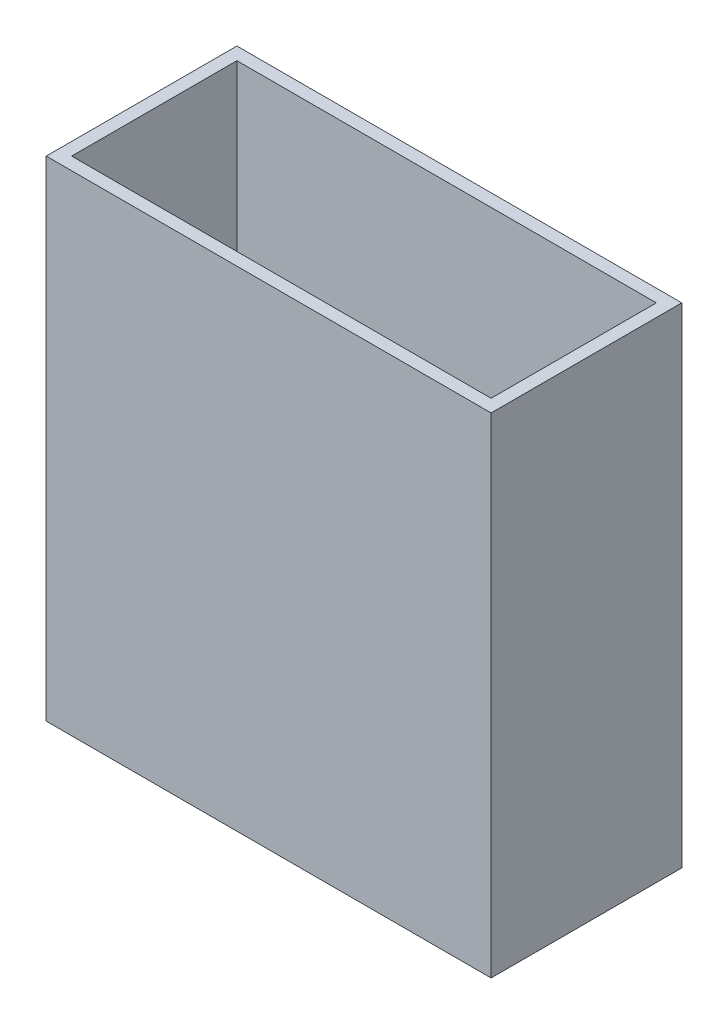
ISO-10303-21;
HEADER;
FILE_DESCRIPTION(('STEP AP214'),'2;1');
FILE_NAME('part.step','',(''),(''),'','','');
FILE_SCHEMA(('AUTOMOTIVE_DESIGN { 1 0 10303 214 1 1 1 1 }'));
ENDSEC;
DATA;
#1=APPLICATION_CONTEXT('core data for automotive mechanical design processes');
#2=APPLICATION_PROTOCOL_DEFINITION('international standard','automotive_design',2000,#1);
#3=PRODUCT_CONTEXT('',#1,'mechanical');
#4=PRODUCT('Part','Part','',(#3));
#5=PRODUCT_RELATED_PRODUCT_CATEGORY('part','',(#4));
#6=PRODUCT_DEFINITION_FORMATION('','',#4);
#7=PRODUCT_DEFINITION_CONTEXT('part definition',#1,'design');
#8=PRODUCT_DEFINITION('design','',#6,#7);
#9=PRODUCT_DEFINITION_SHAPE('','',#8);
#10=(LENGTH_UNIT() NAMED_UNIT(*) SI_UNIT(.MILLI.,.METRE.));
#11=(NAMED_UNIT(*) PLANE_ANGLE_UNIT() SI_UNIT($,.RADIAN.));
#12=(NAMED_UNIT(*) SI_UNIT($,.STERADIAN.) SOLID_ANGLE_UNIT());
#13=UNCERTAINTY_MEASURE_WITH_UNIT(LENGTH_MEASURE(1.E-05),#10,'distance_accuracy_value','');
#14=(GEOMETRIC_REPRESENTATION_CONTEXT(3) GLOBAL_UNCERTAINTY_ASSIGNED_CONTEXT((#13)) GLOBAL_UNIT_ASSIGNED_CONTEXT((#10,
#11,#12)) REPRESENTATION_CONTEXT('',''));
#15=CARTESIAN_POINT('',(0.,0.,0.));
#16=DIRECTION('',(0.,0.,1.));
#17=DIRECTION('',(1.,0.,0.));
#18=AXIS2_PLACEMENT_3D('',#15,#16,#17);
#19=CARTESIAN_POINT('',(4.,150.,4.));
#20=DIRECTION('',(1.,0.,0.));
#21=DIRECTION('',(0.,0.,-1.));
#22=AXIS2_PLACEMENT_3D('',#19,#20,#21);
#23=PLANE('',#22);
#24=DIRECTION('',(0.,-1.,0.));
#25=VECTOR('',#24,1.);
#26=CARTESIAN_POINT('',(4.,9.05,19.));
#27=LINE('',#26,#25);
#28=CARTESIAN_POINT('',(4.,9.05,19.));
#29=VERTEX_POINT('',#28);
#30=CARTESIAN_POINT('',(4.,4.95,19.));
#31=VERTEX_POINT('',#30);
#32=EDGE_CURVE('E187',#29,#31,#27,.T.);
#33=ORIENTED_EDGE('',*,*,#32,.T.);
#34=DIRECTION('',(0.,0.,1.));
#35=VECTOR('',#34,1.);
#36=CARTESIAN_POINT('',(4.,4.95,19.));
#37=LINE('',#36,#35);
#38=CARTESIAN_POINT('',(4.,4.95000000000001,21.5));
#39=VERTEX_POINT('',#38);
#40=EDGE_CURVE('E199',#31,#39,#37,.T.);
#41=ORIENTED_EDGE('',*,*,#40,.T.);
#42=DIRECTION('',(0.,1.,0.));
#43=VECTOR('',#42,1.);
#44=CARTESIAN_POINT('',(4.,9.05,21.5));
#45=LINE('',#44,#43);
#46=CARTESIAN_POINT('',(4.,9.05,21.5));
#47=VERTEX_POINT('',#46);
#48=EDGE_CURVE('E55',#39,#47,#45,.T.);
#49=ORIENTED_EDGE('',*,*,#48,.T.);
#50=DIRECTION('',(0.,0.,-1.));
#51=VECTOR('',#50,1.);
#52=CARTESIAN_POINT('',(4.,9.05,19.));
#53=LINE('',#52,#51);
#54=EDGE_CURVE('E196',#47,#29,#53,.T.);
#55=ORIENTED_EDGE('',*,*,#54,.T.);
#56=EDGE_LOOP('',(#33,#41,#49,#55));
#57=FACE_BOUND('',#56,.T.);
#58=DIRECTION('',(0.,0.,-1.));
#59=VECTOR('',#58,1.);
#60=CARTESIAN_POINT('',(4.,9.04999999999999,41.));
#61=LINE('',#60,#59);
#62=CARTESIAN_POINT('',(4.,9.04999999999999,41.));
#63=VERTEX_POINT('',#62);
#64=CARTESIAN_POINT('',(4.,9.04999999999999,38.5));
#65=VERTEX_POINT('',#64);
#66=EDGE_CURVE('E236',#63,#65,#61,.T.);
#67=ORIENTED_EDGE('',*,*,#66,.T.);
#68=DIRECTION('',(0.,-1.,0.));
#69=VECTOR('',#68,1.);
#70=CARTESIAN_POINT('',(4.,9.04999999999999,38.5));
#71=LINE('',#70,#69);
#72=CARTESIAN_POINT('',(4.,4.95000000000001,38.5));
#73=VERTEX_POINT('',#72);
#74=EDGE_CURVE('E240',#65,#73,#71,.T.);
#75=ORIENTED_EDGE('',*,*,#74,.T.);
#76=DIRECTION('',(0.,0.,1.));
#77=VECTOR('',#76,1.);
#78=CARTESIAN_POINT('',(4.,4.95,41.));
#79=LINE('',#78,#77);
#80=CARTESIAN_POINT('',(4.,4.95,41.));
#81=VERTEX_POINT('',#80);
#82=EDGE_CURVE('E63',#73,#81,#79,.T.);
#83=ORIENTED_EDGE('',*,*,#82,.T.);
#84=DIRECTION('',(0.,1.,0.));
#85=VECTOR('',#84,1.);
#86=CARTESIAN_POINT('',(4.,9.04999999999999,41.));
#87=LINE('',#86,#85);
#88=EDGE_CURVE('E247',#81,#63,#87,.T.);
#89=ORIENTED_EDGE('',*,*,#88,.T.);
#90=EDGE_LOOP('',(#67,#75,#83,#89));
#91=FACE_BOUND('',#90,.T.);
#92=DIRECTION('',(0.,1.,0.));
#93=VECTOR('',#92,1.);
#94=CARTESIAN_POINT('',(4.,0.,33.));
#95=LINE('',#94,#93);
#96=CARTESIAN_POINT('',(4.,0.171428571428573,33.));
#97=VERTEX_POINT('',#96);
#98=CARTESIAN_POINT('',(4.,2.,33.));
#99=VERTEX_POINT('',#98);
#100=EDGE_CURVE('E311',#97,#99,#95,.T.);
#101=ORIENTED_EDGE('',*,*,#100,.T.);
#102=CARTESIAN_POINT('',(4.,2.,30.));
#103=DIRECTION('',(-1.,0.,0.));
#104=DIRECTION('',(0.,0.,-1.));
#105=AXIS2_PLACEMENT_3D('',#102,#103,#104);
#106=ELLIPSE('',#105,3.,2.5);
#107=CARTESIAN_POINT('',(4.,2.,27.));
#108=VERTEX_POINT('',#107);
#109=EDGE_CURVE('E302',#99,#108,#106,.T.);
#110=ORIENTED_EDGE('',*,*,#109,.T.);
#111=DIRECTION('',(0.,-1.,0.));
#112=VECTOR('',#111,1.);
#113=CARTESIAN_POINT('',(4.,0.,27.));
#114=LINE('',#113,#112);
#115=CARTESIAN_POINT('',(4.,0.171428571428572,27.));
#116=VERTEX_POINT('',#115);
#117=EDGE_CURVE('E296',#108,#116,#114,.T.);
#118=ORIENTED_EDGE('',*,*,#117,.T.);
#119=DIRECTION('',(0.,0.,-1.));
#120=VECTOR('',#119,1.);
#121=CARTESIAN_POINT('',(4.,0.171428571428572,4.));
#122=LINE('',#121,#120);
#123=CARTESIAN_POINT('',(4.,0.171428571428557,4.));
#124=VERTEX_POINT('',#123);
#125=EDGE_CURVE('E416',#116,#124,#122,.T.);
#126=ORIENTED_EDGE('',*,*,#125,.T.);
#127=DIRECTION('',(0.,-1.,0.));
#128=VECTOR('',#127,1.);
#129=CARTESIAN_POINT('',(4.,150.,4.));
#130=LINE('',#129,#128);
#131=CARTESIAN_POINT('',(4.,150.,4.));
#132=VERTEX_POINT('',#131);
#133=EDGE_CURVE('E435',#132,#124,#130,.T.);
#134=ORIENTED_EDGE('',*,*,#133,.F.);
#135=DIRECTION('',(0.,0.,1.));
#136=VECTOR('',#135,1.);
#137=CARTESIAN_POINT('',(4.,150.,4.));
#138=LINE('',#137,#136);
#139=CARTESIAN_POINT('',(4.00000000000001,150.,56.));
#140=VERTEX_POINT('',#139);
#141=EDGE_CURVE('E421',#132,#140,#138,.T.);
#142=ORIENTED_EDGE('',*,*,#141,.T.);
#143=DIRECTION('',(0.,-1.,0.));
#144=VECTOR('',#143,1.);
#145=CARTESIAN_POINT('',(4.00000000000001,150.,56.));
#146=LINE('',#145,#144);
#147=CARTESIAN_POINT('',(4.00000000000001,0.171428571428557,56.));
#148=VERTEX_POINT('',#147);
#149=EDGE_CURVE('E447',#140,#148,#146,.T.);
#150=ORIENTED_EDGE('',*,*,#149,.T.);
#151=EDGE_CURVE('E417',#148,#97,#122,.T.);
#152=ORIENTED_EDGE('',*,*,#151,.T.);
#153=EDGE_LOOP('',(#101,#110,#118,#126,#134,#142,#150,#152));
#154=FACE_BOUND('',#153,.T.);
#155=ADVANCED_FACE('F39',(#57,#91,#154),#23,.T.);
#156=CARTESIAN_POINT('',(4.00000000000001,150.,56.));
#157=DIRECTION('',(0.,0.,-1.));
#158=DIRECTION('',(-1.,0.,0.));
#159=AXIS2_PLACEMENT_3D('',#156,#157,#158);
#160=PLANE('',#159);
#161=DIRECTION('',(0.,-1.,0.));
#162=VECTOR('',#161,1.);
#163=CARTESIAN_POINT('',(136.,150.,56.));
#164=LINE('',#163,#162);
#165=CARTESIAN_POINT('',(136.,150.,56.));
#166=VERTEX_POINT('',#165);
#167=CARTESIAN_POINT('',(136.,5.82857142857143,56.));
#168=VERTEX_POINT('',#167);
#169=EDGE_CURVE('E443',#166,#168,#164,.T.);
#170=ORIENTED_EDGE('',*,*,#169,.T.);
#171=DIRECTION('',(-0.99908289581767,-0.042817838392186,0.));
#172=VECTOR('',#171,1.);
#173=CARTESIAN_POINT('',(10.4094520268894,0.446119372580961,56.));
#174=LINE('',#173,#172);
#175=EDGE_CURVE('E412',#168,#148,#174,.T.);
#176=ORIENTED_EDGE('',*,*,#175,.T.);
#177=ORIENTED_EDGE('',*,*,#149,.F.);
#178=DIRECTION('',(1.,0.,0.));
#179=VECTOR('',#178,1.);
#180=CARTESIAN_POINT('',(4.00000000000001,150.,56.));
#181=LINE('',#180,#179);
#182=EDGE_CURVE('E425',#140,#166,#181,.T.);
#183=ORIENTED_EDGE('',*,*,#182,.T.);
#184=EDGE_LOOP('',(#170,#176,#177,#183));
#185=FACE_BOUND('',#184,.T.);
#186=ADVANCED_FACE('F363',(#185),#160,.T.);
#187=CARTESIAN_POINT('',(136.,150.,4.));
#188=DIRECTION('',(-1.,0.,0.));
#189=DIRECTION('',(0.,0.,1.));
#190=AXIS2_PLACEMENT_3D('',#187,#188,#189);
#191=PLANE('',#190);
#192=DIRECTION('',(0.,-1.,0.));
#193=VECTOR('',#192,1.);
#194=CARTESIAN_POINT('',(136.,150.,4.));
#195=LINE('',#194,#193);
#196=CARTESIAN_POINT('',(136.,150.,4.));
#197=VERTEX_POINT('',#196);
#198=CARTESIAN_POINT('',(136.,5.82857142857143,4.));
#199=VERTEX_POINT('',#198);
#200=EDGE_CURVE('E439',#197,#199,#195,.T.);
#201=ORIENTED_EDGE('',*,*,#200,.T.);
#202=DIRECTION('',(0.,0.,1.));
#203=VECTOR('',#202,1.);
#204=CARTESIAN_POINT('',(136.,5.82857142857143,4.));
#205=LINE('',#204,#203);
#206=EDGE_CURVE('E396',#199,#168,#205,.T.);
#207=ORIENTED_EDGE('',*,*,#206,.T.);
#208=ORIENTED_EDGE('',*,*,#169,.F.);
#209=DIRECTION('',(0.,0.,-1.));
#210=VECTOR('',#209,1.);
#211=CARTESIAN_POINT('',(136.,150.,4.));
#212=LINE('',#211,#210);
#213=EDGE_CURVE('E428',#166,#197,#212,.T.);
#214=ORIENTED_EDGE('',*,*,#213,.T.);
#215=EDGE_LOOP('',(#201,#207,#208,#214));
#216=FACE_BOUND('',#215,.T.);
#217=ADVANCED_FACE('F359',(#216),#191,.T.);
#218=CARTESIAN_POINT('',(4.,150.,4.));
#219=DIRECTION('',(0.,0.,1.));
#220=DIRECTION('',(1.,0.,0.));
#221=AXIS2_PLACEMENT_3D('',#218,#219,#220);
#222=PLANE('',#221);
#223=ORIENTED_EDGE('',*,*,#133,.T.);
#224=DIRECTION('',(0.99908289581767,0.042817838392186,0.));
#225=VECTOR('',#224,1.);
#226=CARTESIAN_POINT('',(10.4094520268894,0.446119372580961,4.));
#227=LINE('',#226,#225);
#228=EDGE_CURVE('E11',#124,#199,#227,.T.);
#229=ORIENTED_EDGE('',*,*,#228,.T.);
#230=ORIENTED_EDGE('',*,*,#200,.F.);
#231=DIRECTION('',(-1.,0.,0.));
#232=VECTOR('',#231,1.);
#233=CARTESIAN_POINT('',(4.,150.,4.));
#234=LINE('',#233,#232);
#235=EDGE_CURVE('E432',#197,#132,#234,.T.);
#236=ORIENTED_EDGE('',*,*,#235,.T.);
#237=EDGE_LOOP('',(#223,#229,#230,#236));
#238=FACE_BOUND('',#237,.T.);
#239=ADVANCED_FACE('F355',(#238),#222,.T.);
#240=CARTESIAN_POINT('',(0.,150.,0.));
#241=DIRECTION('',(0.,1.,0.));
#242=DIRECTION('',(0.,0.,1.));
#243=AXIS2_PLACEMENT_3D('',#240,#241,#242);
#244=PLANE('',#243);
#245=DIRECTION('',(0.,0.,1.));
#246=VECTOR('',#245,1.);
#247=CARTESIAN_POINT('',(0.,150.,0.));
#248=LINE('',#247,#246);
#249=CARTESIAN_POINT('',(0.,150.,0.));
#250=VERTEX_POINT('',#249);
#251=CARTESIAN_POINT('',(0.,150.,60.));
#252=VERTEX_POINT('',#251);
#253=EDGE_CURVE('E451',#250,#252,#248,.T.);
#254=ORIENTED_EDGE('',*,*,#253,.T.);
#255=DIRECTION('',(1.,0.,0.));
#256=VECTOR('',#255,1.);
#257=CARTESIAN_POINT('',(0.,150.,60.));
#258=LINE('',#257,#256);
#259=CARTESIAN_POINT('',(140.,150.,60.));
#260=VERTEX_POINT('',#259);
#261=EDGE_CURVE('E455',#252,#260,#258,.T.);
#262=ORIENTED_EDGE('',*,*,#261,.T.);
#263=DIRECTION('',(0.,0.,-1.));
#264=VECTOR('',#263,1.);
#265=CARTESIAN_POINT('',(140.,150.,0.));
#266=LINE('',#265,#264);
#267=CARTESIAN_POINT('',(140.,150.,0.));
#268=VERTEX_POINT('',#267);
#269=EDGE_CURVE('E458',#260,#268,#266,.T.);
#270=ORIENTED_EDGE('',*,*,#269,.T.);
#271=DIRECTION('',(-1.,0.,0.));
#272=VECTOR('',#271,1.);
#273=CARTESIAN_POINT('',(0.,150.,0.));
#274=LINE('',#273,#272);
#275=EDGE_CURVE('E461',#268,#250,#274,.T.);
#276=ORIENTED_EDGE('',*,*,#275,.T.);
#277=EDGE_LOOP('',(#254,#262,#270,#276));
#278=FACE_BOUND('',#277,.T.);
#279=ORIENTED_EDGE('',*,*,#182,.F.);
#280=ORIENTED_EDGE('',*,*,#141,.F.);
#281=ORIENTED_EDGE('',*,*,#235,.F.);
#282=ORIENTED_EDGE('',*,*,#213,.F.);
#283=EDGE_LOOP('',(#279,#280,#281,#282));
#284=FACE_BOUND('',#283,.T.);
#285=ADVANCED_FACE('F358',(#278,#284),#244,.T.);
#286=CARTESIAN_POINT('',(0.,150.,0.));
#287=DIRECTION('',(1.,0.,0.));
#288=DIRECTION('',(0.,0.,-1.));
#289=AXIS2_PLACEMENT_3D('',#286,#287,#288);
#290=PLANE('',#289);
#291=DIRECTION('',(0.,0.,1.));
#292=VECTOR('',#291,1.);
#293=CARTESIAN_POINT('',(0.,4.95,19.));
#294=LINE('',#293,#292);
#295=CARTESIAN_POINT('',(0.,4.95000000000001,19.));
#296=VERTEX_POINT('',#295);
#297=CARTESIAN_POINT('',(0.,4.95,21.5));
#298=VERTEX_POINT('',#297);
#299=EDGE_CURVE('E220',#296,#298,#294,.T.);
#300=ORIENTED_EDGE('',*,*,#299,.F.);
#301=DIRECTION('',(0.,-1.,0.));
#302=VECTOR('',#301,1.);
#303=CARTESIAN_POINT('',(0.,9.05,19.));
#304=LINE('',#303,#302);
#305=CARTESIAN_POINT('',(0.,9.05,19.));
#306=VERTEX_POINT('',#305);
#307=EDGE_CURVE('E190',#306,#296,#304,.T.);
#308=ORIENTED_EDGE('',*,*,#307,.F.);
#309=DIRECTION('',(0.,0.,-1.));
#310=VECTOR('',#309,1.);
#311=CARTESIAN_POINT('',(0.,9.05,19.));
#312=LINE('',#311,#310);
#313=CARTESIAN_POINT('',(0.,9.05,21.5));
#314=VERTEX_POINT('',#313);
#315=EDGE_CURVE('E207',#314,#306,#312,.T.);
#316=ORIENTED_EDGE('',*,*,#315,.F.);
#317=DIRECTION('',(0.,1.,0.));
#318=VECTOR('',#317,1.);
#319=CARTESIAN_POINT('',(0.,9.05,21.5));
#320=LINE('',#319,#318);
#321=EDGE_CURVE('E211',#298,#314,#320,.T.);
#322=ORIENTED_EDGE('',*,*,#321,.F.);
#323=EDGE_LOOP('',(#300,#308,#316,#322));
#324=FACE_BOUND('',#323,.T.);
#325=DIRECTION('',(0.,-1.,0.));
#326=VECTOR('',#325,1.);
#327=CARTESIAN_POINT('',(0.,9.04999999999999,38.5));
#328=LINE('',#327,#326);
#329=CARTESIAN_POINT('',(0.,9.05,38.5));
#330=VERTEX_POINT('',#329);
#331=CARTESIAN_POINT('',(0.,4.95,38.5));
#332=VERTEX_POINT('',#331);
#333=EDGE_CURVE('E255',#330,#332,#328,.T.);
#334=ORIENTED_EDGE('',*,*,#333,.F.);
#335=DIRECTION('',(0.,0.,-1.));
#336=VECTOR('',#335,1.);
#337=CARTESIAN_POINT('',(0.,9.04999999999999,41.));
#338=LINE('',#337,#336);
#339=CARTESIAN_POINT('',(0.,9.04999999999999,41.));
#340=VERTEX_POINT('',#339);
#341=EDGE_CURVE('E252',#340,#330,#338,.T.);
#342=ORIENTED_EDGE('',*,*,#341,.F.);
#343=DIRECTION('',(0.,1.,0.));
#344=VECTOR('',#343,1.);
#345=CARTESIAN_POINT('',(0.,9.04999999999999,41.));
#346=LINE('',#345,#344);
#347=CARTESIAN_POINT('',(0.,4.95,41.));
#348=VERTEX_POINT('',#347);
#349=EDGE_CURVE('E241',#348,#340,#346,.T.);
#350=ORIENTED_EDGE('',*,*,#349,.F.);
#351=DIRECTION('',(0.,0.,1.));
#352=VECTOR('',#351,1.);
#353=CARTESIAN_POINT('',(0.,4.95,41.));
#354=LINE('',#353,#352);
#355=EDGE_CURVE('E259',#332,#348,#354,.T.);
#356=ORIENTED_EDGE('',*,*,#355,.F.);
#357=EDGE_LOOP('',(#334,#342,#350,#356));
#358=FACE_BOUND('',#357,.T.);
#359=DIRECTION('',(0.,1.,0.));
#360=VECTOR('',#359,1.);
#361=CARTESIAN_POINT('',(0.,0.,33.));
#362=LINE('',#361,#360);
#363=CARTESIAN_POINT('',(0.,0.,33.));
#364=VERTEX_POINT('',#363);
#365=CARTESIAN_POINT('',(0.,2.,33.));
#366=VERTEX_POINT('',#365);
#367=EDGE_CURVE('E281',#364,#366,#362,.T.);
#368=ORIENTED_EDGE('',*,*,#367,.F.);
#369=DIRECTION('',(0.,0.,1.));
#370=VECTOR('',#369,1.);
#371=CARTESIAN_POINT('',(0.,0.,27.));
#372=LINE('',#371,#370);
#373=CARTESIAN_POINT('',(0.,0.,27.));
#374=VERTEX_POINT('',#373);
#375=EDGE_CURVE('E285',#374,#364,#372,.T.);
#376=ORIENTED_EDGE('',*,*,#375,.F.);
#377=DIRECTION('',(0.,-1.,0.));
#378=VECTOR('',#377,1.);
#379=CARTESIAN_POINT('',(0.,0.,27.));
#380=LINE('',#379,#378);
#381=CARTESIAN_POINT('',(0.,2.,27.));
#382=VERTEX_POINT('',#381);
#383=EDGE_CURVE('E230',#382,#374,#380,.T.);
#384=ORIENTED_EDGE('',*,*,#383,.F.);
#385=CARTESIAN_POINT('',(0.,2.,30.));
#386=DIRECTION('',(-1.,0.,0.));
#387=DIRECTION('',(0.,0.,-1.));
#388=AXIS2_PLACEMENT_3D('',#385,#386,#387);
#389=ELLIPSE('',#388,3.,2.5);
#390=EDGE_CURVE('E277',#366,#382,#389,.T.);
#391=ORIENTED_EDGE('',*,*,#390,.F.);
#392=EDGE_LOOP('',(#368,#376,#384,#391));
#393=FACE_BOUND('',#392,.T.);
#394=DIRECTION('',(0.,-1.,0.));
#395=VECTOR('',#394,1.);
#396=CARTESIAN_POINT('',(0.,150.,0.));
#397=LINE('',#396,#395);
#398=CARTESIAN_POINT('',(0.,-4.,0.));
#399=VERTEX_POINT('',#398);
#400=EDGE_CURVE('E464',#250,#399,#397,.T.);
#401=ORIENTED_EDGE('',*,*,#400,.T.);
#402=DIRECTION('',(0.,0.,-1.));
#403=VECTOR('',#402,1.);
#404=CARTESIAN_POINT('',(0.,-4.,200.356688476182));
#405=LINE('',#404,#403);
#406=CARTESIAN_POINT('',(0.,-4.,60.));
#407=VERTEX_POINT('',#406);
#408=EDGE_CURVE('E397',#407,#399,#405,.T.);
#409=ORIENTED_EDGE('',*,*,#408,.F.);
#410=DIRECTION('',(0.,-1.,0.));
#411=VECTOR('',#410,1.);
#412=CARTESIAN_POINT('',(0.,150.,60.));
#413=LINE('',#412,#411);
#414=EDGE_CURVE('E48',#252,#407,#413,.T.);
#415=ORIENTED_EDGE('',*,*,#414,.F.);
#416=ORIENTED_EDGE('',*,*,#253,.F.);
#417=EDGE_LOOP('',(#401,#409,#415,#416));
#418=FACE_BOUND('',#417,.T.);
#419=ADVANCED_FACE('F41',(#324,#358,#393,#418),#290,.F.);
#420=CARTESIAN_POINT('',(0.,150.,60.));
#421=DIRECTION('',(0.,0.,-1.));
#422=DIRECTION('',(-1.,0.,0.));
#423=AXIS2_PLACEMENT_3D('',#420,#421,#422);
#424=PLANE('',#423);
#425=DIRECTION('',(-1.,0.,0.));
#426=VECTOR('',#425,1.);
#427=CARTESIAN_POINT('',(140.,-3.99999999999998,60.));
#428=LINE('',#427,#426);
#429=CARTESIAN_POINT('',(140.,-3.99999999999998,60.));
#430=VERTEX_POINT('',#429);
#431=EDGE_CURVE('E324',#430,#407,#428,.T.);
#432=ORIENTED_EDGE('',*,*,#431,.F.);
#433=DIRECTION('',(0.,-1.,0.));
#434=VECTOR('',#433,1.);
#435=CARTESIAN_POINT('',(140.,150.,60.));
#436=LINE('',#435,#434);
#437=EDGE_CURVE('E390',#260,#430,#436,.T.);
#438=ORIENTED_EDGE('',*,*,#437,.F.);
#439=ORIENTED_EDGE('',*,*,#261,.F.);
#440=ORIENTED_EDGE('',*,*,#414,.T.);
#441=EDGE_LOOP('',(#432,#438,#439,#440));
#442=FACE_BOUND('',#441,.T.);
#443=ADVANCED_FACE('F378',(#442),#424,.F.);
#444=CARTESIAN_POINT('',(140.,150.,0.));
#445=DIRECTION('',(-1.,0.,0.));
#446=DIRECTION('',(0.,0.,1.));
#447=AXIS2_PLACEMENT_3D('',#444,#445,#446);
#448=PLANE('',#447);
#449=DIRECTION('',(0.,0.,-1.));
#450=VECTOR('',#449,1.);
#451=CARTESIAN_POINT('',(140.,-3.99999999999998,200.356688476182));
#452=LINE('',#451,#450);
#453=CARTESIAN_POINT('',(140.,-3.99999999999998,0.));
#454=VERTEX_POINT('',#453);
#455=EDGE_CURVE('E400',#430,#454,#452,.T.);
#456=ORIENTED_EDGE('',*,*,#455,.T.);
#457=DIRECTION('',(0.,-1.,0.));
#458=VECTOR('',#457,1.);
#459=CARTESIAN_POINT('',(140.,150.,0.));
#460=LINE('',#459,#458);
#461=EDGE_CURVE('E467',#268,#454,#460,.T.);
#462=ORIENTED_EDGE('',*,*,#461,.F.);
#463=ORIENTED_EDGE('',*,*,#269,.F.);
#464=ORIENTED_EDGE('',*,*,#437,.T.);
#465=EDGE_LOOP('',(#456,#462,#463,#464));
#466=FACE_BOUND('',#465,.T.);
#467=ADVANCED_FACE('F375',(#466),#448,.F.);
#468=CARTESIAN_POINT('',(0.,150.,0.));
#469=DIRECTION('',(0.,0.,1.));
#470=DIRECTION('',(1.,0.,0.));
#471=AXIS2_PLACEMENT_3D('',#468,#469,#470);
#472=PLANE('',#471);
#473=ORIENTED_EDGE('',*,*,#461,.T.);
#474=DIRECTION('',(1.,0.,0.));
#475=VECTOR('',#474,1.);
#476=CARTESIAN_POINT('',(140.,-3.99999999999998,0.));
#477=LINE('',#476,#475);
#478=EDGE_CURVE('E321',#399,#454,#477,.T.);
#479=ORIENTED_EDGE('',*,*,#478,.F.);
#480=ORIENTED_EDGE('',*,*,#400,.F.);
#481=ORIENTED_EDGE('',*,*,#275,.F.);
#482=EDGE_LOOP('',(#473,#479,#480,#481));
#483=FACE_BOUND('',#482,.T.);
#484=ADVANCED_FACE('F350',(#483),#472,.F.);
#485=CARTESIAN_POINT('',(0.,0.,200.356688476182));
#486=DIRECTION('',(0.042817838392186,-0.99908289581767,0.));
#487=DIRECTION('',(0.99908289581767,0.042817838392186,0.));
#488=AXIS2_PLACEMENT_3D('',#485,#486,#487);
#489=PLANE('',#488);
#490=ORIENTED_EDGE('',*,*,#151,.F.);
#491=ORIENTED_EDGE('',*,*,#175,.F.);
#492=ORIENTED_EDGE('',*,*,#206,.F.);
#493=ORIENTED_EDGE('',*,*,#228,.F.);
#494=ORIENTED_EDGE('',*,*,#125,.F.);
#495=EDGE_CURVE('E422',#97,#116,#122,.T.);
#496=ORIENTED_EDGE('',*,*,#495,.F.);
#497=EDGE_LOOP('',(#490,#491,#492,#493,#494,#496));
#498=FACE_BOUND('',#497,.T.);
#499=ADVANCED_FACE('F347',(#498),#489,.F.);
#500=CARTESIAN_POINT('',(140.,-3.99999999999998,200.356688476182));
#501=DIRECTION('',(0.,1.,0.));
#502=DIRECTION('',(-1.,0.,0.));
#503=AXIS2_PLACEMENT_3D('',#500,#501,#502);
#504=PLANE('',#503);
#505=ORIENTED_EDGE('',*,*,#455,.F.);
#506=ORIENTED_EDGE('',*,*,#431,.T.);
#507=ORIENTED_EDGE('',*,*,#408,.T.);
#508=ORIENTED_EDGE('',*,*,#478,.T.);
#509=EDGE_LOOP('',(#505,#506,#507,#508));
#510=FACE_BOUND('',#509,.T.);
#511=ADVANCED_FACE('F345',(#510),#504,.F.);
#512=CARTESIAN_POINT('',(4.,150.,4.));
#513=DIRECTION('',(1.,0.,0.));
#514=DIRECTION('',(0.,0.,-1.));
#515=AXIS2_PLACEMENT_3D('',#512,#513,#514);
#516=PLANE('',#515);
#517=CARTESIAN_POINT('',(4.,0.,27.));
#518=VERTEX_POINT('',#517);
#519=EDGE_CURVE('E301',#116,#518,#114,.T.);
#520=ORIENTED_EDGE('',*,*,#519,.T.);
#521=DIRECTION('',(0.,0.,1.));
#522=VECTOR('',#521,1.);
#523=CARTESIAN_POINT('',(4.,0.,27.));
#524=LINE('',#523,#522);
#525=CARTESIAN_POINT('',(4.,0.,33.));
#526=VERTEX_POINT('',#525);
#527=EDGE_CURVE('E280',#518,#526,#524,.T.);
#528=ORIENTED_EDGE('',*,*,#527,.T.);
#529=EDGE_CURVE('E308',#526,#97,#95,.T.);
#530=ORIENTED_EDGE('',*,*,#529,.T.);
#531=ORIENTED_EDGE('',*,*,#495,.T.);
#532=EDGE_LOOP('',(#520,#528,#530,#531));
#533=FACE_BOUND('',#532,.T.);
#534=ADVANCED_FACE('F341',(#533),#516,.F.);
#535=CARTESIAN_POINT('',(11.5,0.,27.));
#536=DIRECTION('',(0.,-1.,0.));
#537=DIRECTION('',(0.,0.,-1.));
#538=AXIS2_PLACEMENT_3D('',#535,#536,#537);
#539=PLANE('',#538);
#540=DIRECTION('',(-1.,0.,0.));
#541=VECTOR('',#540,1.);
#542=CARTESIAN_POINT('',(11.5,0.,27.));
#543=LINE('',#542,#541);
#544=EDGE_CURVE('E300',#518,#374,#543,.T.);
#545=ORIENTED_EDGE('',*,*,#544,.T.);
#546=ORIENTED_EDGE('',*,*,#375,.T.);
#547=DIRECTION('',(-1.,0.,0.));
#548=VECTOR('',#547,1.);
#549=CARTESIAN_POINT('',(11.5,0.,33.));
#550=LINE('',#549,#548);
#551=EDGE_CURVE('E295',#526,#364,#550,.T.);
#552=ORIENTED_EDGE('',*,*,#551,.F.);
#553=ORIENTED_EDGE('',*,*,#527,.F.);
#554=EDGE_LOOP('',(#545,#546,#552,#553));
#555=FACE_BOUND('',#554,.T.);
#556=ADVANCED_FACE('F337',(#555),#539,.F.);
#557=CARTESIAN_POINT('',(11.5,0.,33.));
#558=DIRECTION('',(0.,0.,1.));
#559=DIRECTION('',(1.,0.,0.));
#560=AXIS2_PLACEMENT_3D('',#557,#558,#559);
#561=PLANE('',#560);
#562=ORIENTED_EDGE('',*,*,#551,.T.);
#563=ORIENTED_EDGE('',*,*,#367,.T.);
#564=DIRECTION('',(-1.,0.,0.));
#565=VECTOR('',#564,1.);
#566=CARTESIAN_POINT('',(11.5,2.,33.));
#567=LINE('',#566,#565);
#568=EDGE_CURVE('E307',#99,#366,#567,.T.);
#569=ORIENTED_EDGE('',*,*,#568,.F.);
#570=ORIENTED_EDGE('',*,*,#100,.F.);
#571=ORIENTED_EDGE('',*,*,#529,.F.);
#572=EDGE_LOOP('',(#562,#563,#569,#570,#571));
#573=FACE_BOUND('',#572,.T.);
#574=ADVANCED_FACE('F332',(#573),#561,.F.);
#575=CARTESIAN_POINT('',(11.5,2.,30.));
#576=DIRECTION('',(-1.,0.,0.));
#577=DIRECTION('',(0.,0.,-1.));
#578=AXIS2_PLACEMENT_3D('',#575,#576,#577);
#579=ELLIPSE('',#578,3.,2.5);
#580=DIRECTION('',(-1.,0.,0.));
#581=VECTOR('',#580,1.);
#582=SURFACE_OF_LINEAR_EXTRUSION('',#579,#581);
#583=ORIENTED_EDGE('',*,*,#568,.T.);
#584=ORIENTED_EDGE('',*,*,#390,.T.);
#585=DIRECTION('',(-1.,0.,0.));
#586=VECTOR('',#585,1.);
#587=CARTESIAN_POINT('',(11.5,2.,27.));
#588=LINE('',#587,#586);
#589=EDGE_CURVE('E306',#108,#382,#588,.T.);
#590=ORIENTED_EDGE('',*,*,#589,.F.);
#591=ORIENTED_EDGE('',*,*,#109,.F.);
#592=EDGE_LOOP('',(#583,#584,#590,#591));
#593=FACE_BOUND('',#592,.T.);
#594=ADVANCED_FACE('F327',(#593),#582,.F.);
#595=CARTESIAN_POINT('',(11.5,0.,27.));
#596=DIRECTION('',(0.,0.,-1.));
#597=DIRECTION('',(0.,1.,0.));
#598=AXIS2_PLACEMENT_3D('',#595,#596,#597);
#599=PLANE('',#598);
#600=ORIENTED_EDGE('',*,*,#589,.T.);
#601=ORIENTED_EDGE('',*,*,#383,.T.);
#602=ORIENTED_EDGE('',*,*,#544,.F.);
#603=ORIENTED_EDGE('',*,*,#519,.F.);
#604=ORIENTED_EDGE('',*,*,#117,.F.);
#605=EDGE_LOOP('',(#600,#601,#602,#603,#604));
#606=FACE_BOUND('',#605,.T.);
#607=ADVANCED_FACE('F331',(#606),#599,.F.);
#608=CARTESIAN_POINT('',(4.,9.04999999999999,41.));
#609=DIRECTION('',(0.,1.,0.));
#610=DIRECTION('',(0.,0.,1.));
#611=AXIS2_PLACEMENT_3D('',#608,#609,#610);
#612=PLANE('',#611);
#613=ORIENTED_EDGE('',*,*,#341,.T.);
#614=DIRECTION('',(-1.,0.,0.));
#615=VECTOR('',#614,1.);
#616=CARTESIAN_POINT('',(4.,9.04999999999999,38.5));
#617=LINE('',#616,#615);
#618=EDGE_CURVE('E251',#65,#330,#617,.T.);
#619=ORIENTED_EDGE('',*,*,#618,.F.);
#620=ORIENTED_EDGE('',*,*,#66,.F.);
#621=DIRECTION('',(-1.,0.,0.));
#622=VECTOR('',#621,1.);
#623=CARTESIAN_POINT('',(4.,9.04999999999999,41.));
#624=LINE('',#623,#622);
#625=EDGE_CURVE('E221',#63,#340,#624,.T.);
#626=ORIENTED_EDGE('',*,*,#625,.T.);
#627=EDGE_LOOP('',(#613,#619,#620,#626));
#628=FACE_BOUND('',#627,.T.);
#629=ADVANCED_FACE('F507',(#628),#612,.F.);
#630=CARTESIAN_POINT('',(4.,9.04999999999999,41.));
#631=DIRECTION('',(0.,0.,1.));
#632=DIRECTION('',(1.,0.,0.));
#633=AXIS2_PLACEMENT_3D('',#630,#631,#632);
#634=PLANE('',#633);
#635=ORIENTED_EDGE('',*,*,#349,.T.);
#636=ORIENTED_EDGE('',*,*,#625,.F.);
#637=ORIENTED_EDGE('',*,*,#88,.F.);
#638=DIRECTION('',(-1.,0.,0.));
#639=VECTOR('',#638,1.);
#640=CARTESIAN_POINT('',(4.,4.95,41.));
#641=LINE('',#640,#639);
#642=EDGE_CURVE('E268',#81,#348,#641,.T.);
#643=ORIENTED_EDGE('',*,*,#642,.T.);
#644=EDGE_LOOP('',(#635,#636,#637,#643));
#645=FACE_BOUND('',#644,.T.);
#646=ADVANCED_FACE('F511',(#645),#634,.F.);
#647=CARTESIAN_POINT('',(4.,4.95,41.));
#648=DIRECTION('',(0.,-1.,0.));
#649=DIRECTION('',(0.,0.,-1.));
#650=AXIS2_PLACEMENT_3D('',#647,#648,#649);
#651=PLANE('',#650);
#652=ORIENTED_EDGE('',*,*,#355,.T.);
#653=ORIENTED_EDGE('',*,*,#642,.F.);
#654=ORIENTED_EDGE('',*,*,#82,.F.);
#655=DIRECTION('',(-1.,0.,0.));
#656=VECTOR('',#655,1.);
#657=CARTESIAN_POINT('',(4.,4.95,38.5));
#658=LINE('',#657,#656);
#659=EDGE_CURVE('E271',#73,#332,#658,.T.);
#660=ORIENTED_EDGE('',*,*,#659,.T.);
#661=EDGE_LOOP('',(#652,#653,#654,#660));
#662=FACE_BOUND('',#661,.T.);
#663=ADVANCED_FACE('F516',(#662),#651,.F.);
#664=CARTESIAN_POINT('',(4.,9.04999999999999,38.5));
#665=DIRECTION('',(0.,0.,-1.));
#666=DIRECTION('',(-1.,0.,0.));
#667=AXIS2_PLACEMENT_3D('',#664,#665,#666);
#668=PLANE('',#667);
#669=ORIENTED_EDGE('',*,*,#333,.T.);
#670=ORIENTED_EDGE('',*,*,#659,.F.);
#671=ORIENTED_EDGE('',*,*,#74,.F.);
#672=ORIENTED_EDGE('',*,*,#618,.T.);
#673=EDGE_LOOP('',(#669,#670,#671,#672));
#674=FACE_BOUND('',#673,.T.);
#675=ADVANCED_FACE('F520',(#674),#668,.F.);
#676=CARTESIAN_POINT('',(4.,9.05,19.));
#677=DIRECTION('',(0.,0.,-1.));
#678=DIRECTION('',(-1.,0.,0.));
#679=AXIS2_PLACEMENT_3D('',#676,#677,#678);
#680=PLANE('',#679);
#681=ORIENTED_EDGE('',*,*,#307,.T.);
#682=DIRECTION('',(-1.,0.,0.));
#683=VECTOR('',#682,1.);
#684=CARTESIAN_POINT('',(4.,4.95,19.));
#685=LINE('',#684,#683);
#686=EDGE_CURVE('E183',#31,#296,#685,.T.);
#687=ORIENTED_EDGE('',*,*,#686,.F.);
#688=ORIENTED_EDGE('',*,*,#32,.F.);
#689=DIRECTION('',(-1.,0.,0.));
#690=VECTOR('',#689,1.);
#691=CARTESIAN_POINT('',(4.,9.05,19.));
#692=LINE('',#691,#690);
#693=EDGE_CURVE('E227',#29,#306,#692,.T.);
#694=ORIENTED_EDGE('',*,*,#693,.T.);
#695=EDGE_LOOP('',(#681,#687,#688,#694));
#696=FACE_BOUND('',#695,.T.);
#697=ADVANCED_FACE('F185',(#696),#680,.F.);
#698=CARTESIAN_POINT('',(4.,9.05,19.));
#699=DIRECTION('',(0.,1.,0.));
#700=DIRECTION('',(0.,0.,1.));
#701=AXIS2_PLACEMENT_3D('',#698,#699,#700);
#702=PLANE('',#701);
#703=ORIENTED_EDGE('',*,*,#315,.T.);
#704=ORIENTED_EDGE('',*,*,#693,.F.);
#705=ORIENTED_EDGE('',*,*,#54,.F.);
#706=DIRECTION('',(-1.,0.,0.));
#707=VECTOR('',#706,1.);
#708=CARTESIAN_POINT('',(4.,9.05,21.5));
#709=LINE('',#708,#707);
#710=EDGE_CURVE('E231',#47,#314,#709,.T.);
#711=ORIENTED_EDGE('',*,*,#710,.T.);
#712=EDGE_LOOP('',(#703,#704,#705,#711));
#713=FACE_BOUND('',#712,.T.);
#714=ADVANCED_FACE('F528',(#713),#702,.F.);
#715=CARTESIAN_POINT('',(4.,9.05,21.5));
#716=DIRECTION('',(0.,0.,1.));
#717=DIRECTION('',(1.,0.,0.));
#718=AXIS2_PLACEMENT_3D('',#715,#716,#717);
#719=PLANE('',#718);
#720=ORIENTED_EDGE('',*,*,#321,.T.);
#721=ORIENTED_EDGE('',*,*,#710,.F.);
#722=ORIENTED_EDGE('',*,*,#48,.F.);
#723=DIRECTION('',(-1.,0.,0.));
#724=VECTOR('',#723,1.);
#725=CARTESIAN_POINT('',(4.,4.95,21.5));
#726=LINE('',#725,#724);
#727=EDGE_CURVE('E195',#39,#298,#726,.T.);
#728=ORIENTED_EDGE('',*,*,#727,.T.);
#729=EDGE_LOOP('',(#720,#721,#722,#728));
#730=FACE_BOUND('',#729,.T.);
#731=ADVANCED_FACE('F531',(#730),#719,.F.);
#732=CARTESIAN_POINT('',(4.,4.95,19.));
#733=DIRECTION('',(0.,-1.,0.));
#734=DIRECTION('',(0.,0.,-1.));
#735=AXIS2_PLACEMENT_3D('',#732,#733,#734);
#736=PLANE('',#735);
#737=ORIENTED_EDGE('',*,*,#299,.T.);
#738=ORIENTED_EDGE('',*,*,#727,.F.);
#739=ORIENTED_EDGE('',*,*,#40,.F.);
#740=ORIENTED_EDGE('',*,*,#686,.T.);
#741=EDGE_LOOP('',(#737,#738,#739,#740));
#742=FACE_BOUND('',#741,.T.);
#743=ADVANCED_FACE('F200',(#742),#736,.F.);
#744=CLOSED_SHELL('',(#155,#186,#217,#239,#285,#419,#443,#467,#484,#499,#511,#534,#556,#574,
#594,#607,#629,#646,#663,#675,#697,#714,#731,#743));
#745=MANIFOLD_SOLID_BREP('B2',#744);
#746=ADVANCED_BREP_SHAPE_REPRESENTATION('',(#18,#745),#14);
#747=SHAPE_DEFINITION_REPRESENTATION(#9,#746);
ENDSEC;
END-ISO-10303-21;
